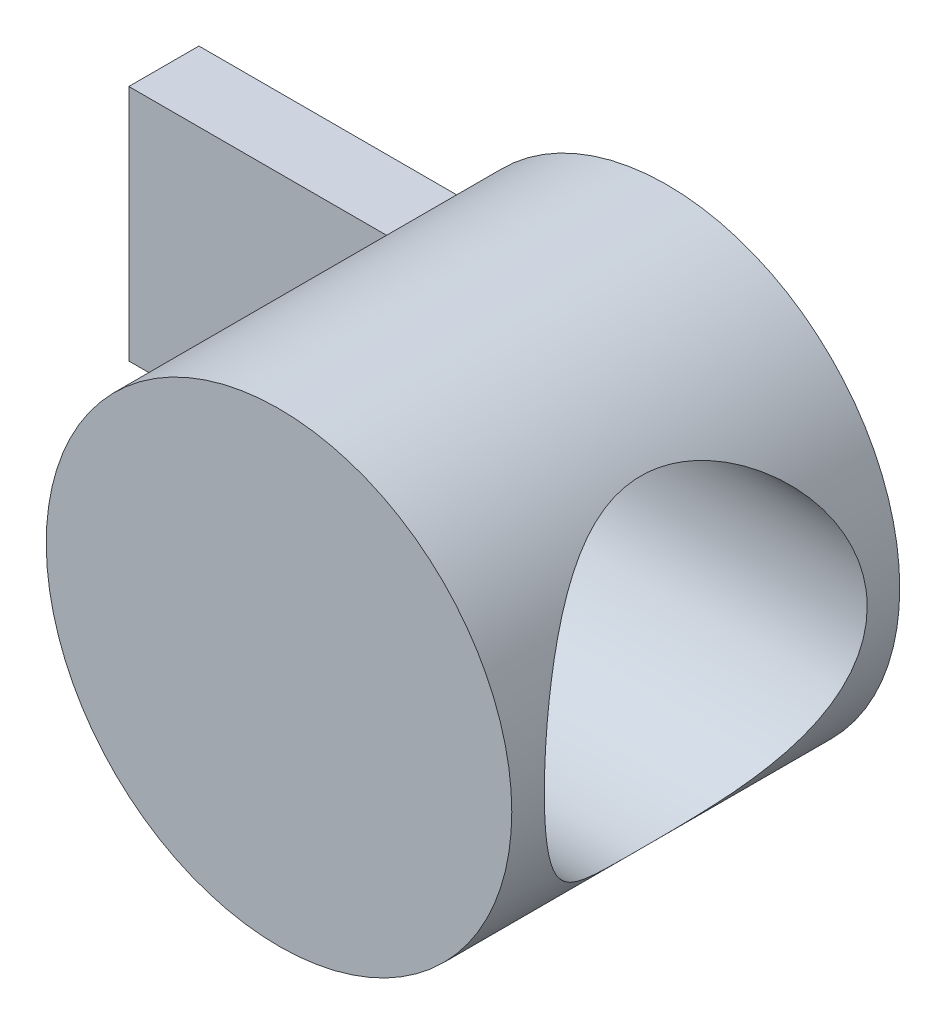
ISO-10303-21;
HEADER;
FILE_DESCRIPTION(('STEP AP214'),'2;1');
FILE_NAME('part.step','',(''),(''),'','','');
FILE_SCHEMA(('AUTOMOTIVE_DESIGN { 1 0 10303 214 1 1 1 1 }'));
ENDSEC;
DATA;
#1=APPLICATION_CONTEXT('core data for automotive mechanical design processes');
#2=APPLICATION_PROTOCOL_DEFINITION('international standard','automotive_design',2000,#1);
#3=PRODUCT_CONTEXT('',#1,'mechanical');
#4=PRODUCT('Part','Part','',(#3));
#5=PRODUCT_RELATED_PRODUCT_CATEGORY('part','',(#4));
#6=PRODUCT_DEFINITION_FORMATION('','',#4);
#7=PRODUCT_DEFINITION_CONTEXT('part definition',#1,'design');
#8=PRODUCT_DEFINITION('design','',#6,#7);
#9=PRODUCT_DEFINITION_SHAPE('','',#8);
#10=(LENGTH_UNIT() NAMED_UNIT(*) SI_UNIT(.MILLI.,.METRE.));
#11=(NAMED_UNIT(*) PLANE_ANGLE_UNIT() SI_UNIT($,.RADIAN.));
#12=(NAMED_UNIT(*) SI_UNIT($,.STERADIAN.) SOLID_ANGLE_UNIT());
#13=UNCERTAINTY_MEASURE_WITH_UNIT(LENGTH_MEASURE(1.E-05),#10,'distance_accuracy_value','');
#14=(GEOMETRIC_REPRESENTATION_CONTEXT(3) GLOBAL_UNCERTAINTY_ASSIGNED_CONTEXT((#13)) GLOBAL_UNIT_ASSIGNED_CONTEXT((#10,
#11,#12)) REPRESENTATION_CONTEXT('',''));
#15=CARTESIAN_POINT('',(0.,0.,0.));
#16=DIRECTION('',(0.,0.,1.));
#17=DIRECTION('',(1.,0.,0.));
#18=AXIS2_PLACEMENT_3D('',#15,#16,#17);
#19=CARTESIAN_POINT('',(0.,0.,15.5));
#20=DIRECTION('',(0.,0.,-1.));
#21=DIRECTION('',(-1.,0.,0.));
#22=AXIS2_PLACEMENT_3D('',#19,#20,#21);
#23=CYLINDRICAL_SURFACE('',#22,9.3);
#24=CARTESIAN_POINT('',(-9.3,0.,11.75));
#25=CARTESIAN_POINT('',(-9.29999934078412,-0.106874233268766,11.749999180276));
#26=CARTESIAN_POINT('',(-9.29815263414507,-0.213780663620482,11.7457107500647));
#27=CARTESIAN_POINT('',(-9.29081243090715,-0.426826724346443,11.7285993885596));
#28=CARTESIAN_POINT('',(-9.28531673348287,-0.532965852857977,11.715771306711));
#29=CARTESIAN_POINT('',(-9.27080661319075,-0.743860828145862,11.681678512347));
#30=CARTESIAN_POINT('',(-9.26178527161917,-0.84861353374658,11.6603972099269));
#31=CARTESIAN_POINT('',(-9.24046521006683,-1.0557832572438,11.6096267848474));
#32=CARTESIAN_POINT('',(-9.22816515052659,-1.15819930186121,11.5801343071946));
#33=CARTESIAN_POINT('',(-9.18689890316545,-1.46009212009065,11.4799956488516));
#34=CARTESIAN_POINT('',(-9.15349521209184,-1.65518930219288,11.3975278514409));
#35=CARTESIAN_POINT('',(-9.07808724187232,-2.02847750626869,11.2039226194193));
#36=CARTESIAN_POINT('',(-9.0360852577465,-2.20667302102981,11.0927928330926));
#37=CARTESIAN_POINT('',(-8.94516066600799,-2.55093806750831,10.838788181007));
#38=CARTESIAN_POINT('',(-8.89600190703451,-2.71600752173623,10.6946402257903));
#39=CARTESIAN_POINT('',(-8.79729337381444,-3.02048114043648,10.3814424423972));
#40=CARTESIAN_POINT('',(-8.74774339701491,-3.15987095744644,10.2123787879452));
#41=CARTESIAN_POINT('',(-8.65087908189079,-3.41644951141554,9.84307196779325));
#42=CARTESIAN_POINT('',(-8.60382407397571,-3.53206187427895,9.64164826862648));
#43=CARTESIAN_POINT('',(-8.54176808512715,-3.67845075700833,9.3256078287111));
#44=CARTESIAN_POINT('',(-8.52249813220127,-3.72275382070134,9.21789987898892));
#45=CARTESIAN_POINT('',(-8.48747098147271,-3.80193559161135,8.99854067347465));
#46=CARTESIAN_POINT('',(-8.4717119391076,-3.83681924964862,8.88689152419947));
#47=CARTESIAN_POINT('',(-8.44499413922509,-3.89526055433711,8.6661489879317));
#48=CARTESIAN_POINT('',(-8.43383508653355,-3.91929651105374,8.55720607891461));
#49=CARTESIAN_POINT('',(-8.41564352796143,-3.95820756216702,8.33740124317627));
#50=CARTESIAN_POINT('',(-8.40860907739749,-3.9730869738911,8.2265402462267));
#51=CARTESIAN_POINT('',(-8.39893093433346,-3.99350569509197,8.00380299327322));
#52=CARTESIAN_POINT('',(-8.39628592554187,-3.99904780461611,7.89192705174984));
#53=CARTESIAN_POINT('',(-8.39548594196916,-4.00072703931844,7.66809333122788));
#54=CARTESIAN_POINT('',(-8.39733070683432,-3.99686470984274,7.55613555735098));
#55=CARTESIAN_POINT('',(-8.40510128951635,-3.98049574440855,7.34236070583505));
#56=CARTESIAN_POINT('',(-8.41067563580138,-3.96873326871917,7.2404732959467));
#57=CARTESIAN_POINT('',(-8.42535088105403,-3.93748018147667,7.03813860421489));
#58=CARTESIAN_POINT('',(-8.43445292684826,-3.91798705670404,6.93769180172471));
#59=CARTESIAN_POINT('',(-8.46665073717504,-3.84818490807235,6.63957925078703));
#60=CARTESIAN_POINT('',(-8.4946451896979,-3.78653950211715,6.44496827714968));
#61=CARTESIAN_POINT('',(-8.56118850758204,-3.63360449382624,6.06479987089936));
#62=CARTESIAN_POINT('',(-8.59995502583085,-3.54169542939094,5.87953393075672));
#63=CARTESIAN_POINT('',(-8.68363263751936,-3.33126590260211,5.526274752652));
#64=CARTESIAN_POINT('',(-8.72854623551185,-3.21273458064965,5.35828860424911));
#65=CARTESIAN_POINT('',(-8.82440362438064,-2.93983406854868,5.02837170978374));
#66=CARTESIAN_POINT('',(-8.87552505478886,-2.7831907181036,4.86836897520677));
#67=CARTESIAN_POINT('',(-8.97462556172128,-2.44482257210579,4.57623037411741));
#68=CARTESIAN_POINT('',(-9.02260380117477,-2.2630911350004,4.44410191023653));
#69=CARTESIAN_POINT('',(-9.11157560302513,-1.87352107509898,4.20838234820323));
#70=CARTESIAN_POINT('',(-9.15235459201257,-1.66512557052148,4.10562455171741));
#71=CARTESIAN_POINT('',(-9.22066393286011,-1.231802188747,3.93731103593724));
#72=CARTESIAN_POINT('',(-9.24820209746839,-1.0068841512173,3.87173337440183));
#73=CARTESIAN_POINT('',(-9.28543781783168,-0.562963835350611,3.78378973918099));
#74=CARTESIAN_POINT('',(-9.29619993100833,-0.344562697171548,3.75884034090852));
#75=CARTESIAN_POINT('',(-9.30210631835257,0.0935553492091293,3.74509842029474));
#76=CARTESIAN_POINT('',(-9.29725545777301,0.313271826231779,3.75629463440459));
#77=CARTESIAN_POINT('',(-9.27316462522996,0.735358138867906,3.81272132058679));
#78=CARTESIAN_POINT('',(-9.25471022260221,0.93802636087062,3.85609450005673));
#79=CARTESIAN_POINT('',(-9.20612989877623,1.33296065437231,3.97301128994111));
#80=CARTESIAN_POINT('',(-9.17600252835549,1.52522543088338,4.04655864660739));
#81=CARTESIAN_POINT('',(-9.10576772262043,1.90069237245226,4.22411709843971));
#82=CARTESIAN_POINT('',(-9.06537793594593,2.08342384409009,4.32900802830656));
#83=CARTESIAN_POINT('',(-8.97886870487735,2.42935392665666,4.56532494888838));
#84=CARTESIAN_POINT('',(-8.9327468119742,2.59254413155178,4.69676229417836));
#85=CARTESIAN_POINT('',(-8.83538757077405,2.90777834795635,4.99404610841186));
#86=CARTESIAN_POINT('',(-8.78402763058276,3.05803679463846,5.16174682727339));
#87=CARTESIAN_POINT('',(-8.6850126328659,3.32887422255633,5.52085059270679));
#88=CARTESIAN_POINT('',(-8.63735863402144,3.44944474395696,5.71226037208272));
#89=CARTESIAN_POINT('',(-8.57253926855411,3.60622355596146,6.01550433026191));
#90=CARTESIAN_POINT('',(-8.55187857485843,3.65481540057085,6.12035722854021));
#91=CARTESIAN_POINT('',(-8.5136947691038,3.74290089859364,6.33435237892022));
#92=CARTESIAN_POINT('',(-8.49617026284308,3.78239859708683,6.44349269858844));
#93=CARTESIAN_POINT('',(-8.4649086499376,3.85185330548593,6.66523193313136));
#94=CARTESIAN_POINT('',(-8.45116958638418,3.88181524620982,6.77782902741711));
#95=CARTESIAN_POINT('',(-8.42800400647033,3.93185859039075,7.0056334179739));
#96=CARTESIAN_POINT('',(-8.41857704610956,3.95194101111933,7.12084044422785));
#97=CARTESIAN_POINT('',(-8.40499639289431,3.98073690178946,7.34344209145978));
#98=CARTESIAN_POINT('',(-8.40047714553189,3.9902400811904,7.45071286076214));
#99=CARTESIAN_POINT('',(-8.39556581784281,4.00056343144308,7.66580412283355));
#100=CARTESIAN_POINT('',(-8.39517511561209,4.00138070296539,7.77362478714143));
#101=CARTESIAN_POINT('',(-8.39854093335341,3.99431196645918,7.98886091773454));
#102=CARTESIAN_POINT('',(-8.40229517680469,3.98643073589348,8.09627657396331));
#103=CARTESIAN_POINT('',(-8.41380431862522,3.96207841716599,8.30992553311475));
#104=CARTESIAN_POINT('',(-8.42156072443419,3.94560409233551,8.41615837510979));
#105=CARTESIAN_POINT('',(-8.44943517608114,3.88574265171909,8.72063312961776));
#106=CARTESIAN_POINT('',(-8.47440811871978,3.83145767803314,8.91640872439248));
#107=CARTESIAN_POINT('',(-8.5349124628419,3.69469760362888,9.29596786059734));
#108=CARTESIAN_POINT('',(-8.57044687055007,3.61221447555759,9.47974796943226));
#109=CARTESIAN_POINT('',(-8.65080127343468,3.41549134866738,9.84275140853213));
#110=CARTESIAN_POINT('',(-8.69606130174304,3.29959542275885,10.0209805926403));
#111=CARTESIAN_POINT('',(-8.78962041264275,3.04161384615776,10.3564229243285));
#112=CARTESIAN_POINT('',(-8.83792065160676,2.89951819001953,10.5136280032826));
#113=CARTESIAN_POINT('',(-8.93676395515045,2.57959961143623,10.8155688397058));
#114=CARTESIAN_POINT('',(-8.98717888985869,2.39983164909883,10.9583116914461));
#115=CARTESIAN_POINT('',(-9.05730937116871,2.1130347440304,11.1482794279201));
#116=CARTESIAN_POINT('',(-9.07978704851892,2.01449043522898,11.2076163014576));
#117=CARTESIAN_POINT('',(-9.12229982890224,1.81226188644151,11.3177638796397));
#118=CARTESIAN_POINT('',(-9.14233606083652,1.70858005343363,11.3685785290019));
#119=CARTESIAN_POINT('',(-9.17913919693844,1.49821685409454,11.4605725790939));
#120=CARTESIAN_POINT('',(-9.19594731960261,1.3915964485553,11.5018750189968));
#121=CARTESIAN_POINT('',(-9.22614604700577,1.17481661259781,11.5752962214402));
#122=CARTESIAN_POINT('',(-9.23953828444775,1.06465890137355,11.6074193723253));
#123=CARTESIAN_POINT('',(-9.26249053354376,0.841890253675319,11.6620767750895));
#124=CARTESIAN_POINT('',(-9.27205986429463,0.729285997193563,11.6846343533202));
#125=CARTESIAN_POINT('',(-9.28711819880892,0.502342860747301,11.7199902661192));
#126=CARTESIAN_POINT('',(-9.2926101206456,0.388005281183421,11.7327955802456));
#127=CARTESIAN_POINT('',(-9.29732037675199,0.227836658726739,11.743766537126));
#128=CARTESIAN_POINT('',(-9.29832457710041,0.182308745964646,11.7461033260502));
#129=CARTESIAN_POINT('',(-9.29966453158249,0.0911891759995516,11.7492202375512));
#130=CARTESIAN_POINT('',(-9.30000028125215,0.0455975183728875,11.7500003497324));
#131=CARTESIAN_POINT('',(-9.3,0.,11.75));
#132=B_SPLINE_CURVE_WITH_KNOTS('',3,(#24,#25,#26,#27,#28,#29,#30,#31,#32,#33,#34,#35,#36,#37,
#38,#39,#40,#41,#42,#43,#44,#45,#46,#47,#48,#49,#50,#51,#52,#53,#54,#55,#56,#57,#58,#59,#60,#61,
#62,#63,#64,#65,#66,#67,#68,#69,#70,#71,#72,#73,#74,#75,#76,#77,#78,#79,#80,#81,#82,#83,#84,#85,
#86,#87,#88,#89,#90,#91,#92,#93,#94,#95,#96,#97,#98,#99,#100,#101,#102,#103,#104,#105,#106,#107,
#108,#109,#110,#111,#112,#113,#114,#115,#116,#117,#118,#119,#120,#121,#122,#123,#124,#125,#126,
#127,#128,#129,#130,#131),.UNSPECIFIED.,.T.,.F.,(4,2,2,2,2,2,2,2,2,2,2,2,2,2,2,2,2,2,2,2,2,2,2,
2,2,2,2,2,2,2,2,2,2,2,2,2,2,2,2,2,2,2,2,2,2,2,2,2,2,2,2,2,2,4),(0.,0.320576390821004,
0.641346307569463,0.962748887961545,1.2842829830251,1.92441462966298,2.56437563732342,
3.23521800483735,3.9064340492845,4.61337274264909,4.96711152448407,5.32066401843424,
5.65657411878873,5.99232571533231,6.32797660957559,6.66360804050502,6.97137934293791,
7.27925078337242,7.89447884807598,8.52317629633768,9.15213066653854,9.83807694083062,
10.5242051546997,11.2282116686491,11.93180227224,12.5886071982172,13.2452074730704,
13.8665973861656,14.4880644708068,15.1289443887639,15.7700990100569,16.459907644884,
17.1499126198456,17.5017140088176,17.8533586127833,18.2048210892942,18.5562473689412,
18.8791827744014,19.2022259713258,19.5250918320613,19.8480793911293,20.4592141144929,
21.0705229586467,21.7198484947643,22.3694225181124,23.0707765912912,23.4220300786806,
23.7731205284597,24.1193765943648,24.4654668475514,24.8107082120184,25.1557022593022,
25.2924741434739,25.4292469410257),.UNSPECIFIED.);
#133=CARTESIAN_POINT('',(-9.3,0.,11.75));
#134=VERTEX_POINT('',#133);
#135=EDGE_CURVE('E39',#134,#134,#132,.T.);
#136=ORIENTED_EDGE('',*,*,#135,.T.);
#137=EDGE_LOOP('',(#136));
#138=FACE_BOUND('',#137,.T.);
#139=CARTESIAN_POINT('',(9.3,0.,1.3));
#140=CARTESIAN_POINT('',(9.30000030059884,-0.160684692975626,1.29999967612022));
#141=CARTESIAN_POINT('',(9.29582699502672,-0.321365433450295,1.3060125600827));
#142=CARTESIAN_POINT('',(9.27923921282349,-0.641399010241401,1.32996456112811));
#143=CARTESIAN_POINT('',(9.26682500923532,-0.800751890376276,1.34790328307624));
#144=CARTESIAN_POINT('',(9.23405344534918,-1.11692807091194,1.39543165193953));
#145=CARTESIAN_POINT('',(9.21369344742395,-1.27375051330746,1.42502516772387));
#146=CARTESIAN_POINT('',(9.16550956391227,-1.58367781798145,1.49542383345956));
#147=CARTESIAN_POINT('',(9.13768551555252,-1.73678259910708,1.53622922791595));
#148=CARTESIAN_POINT('',(9.07534846747479,-2.03752446564334,1.62826888198986));
#149=CARTESIAN_POINT('',(9.04087062107354,-2.18518563069697,1.67944840162127));
#150=CARTESIAN_POINT('',(8.96584252858721,-2.4751020831585,1.79176452540616));
#151=CARTESIAN_POINT('',(8.92528990725224,-2.61735522861943,1.85290502514662));
#152=CARTESIAN_POINT('',(8.79569149143223,-3.03488602686606,2.05029746319019));
#153=CARTESIAN_POINT('',(8.69864900632044,-3.30119594132389,2.2006015311713));
#154=CARTESIAN_POINT('',(8.48082489060524,-3.82805946958879,2.54837715894583));
#155=CARTESIAN_POINT('',(8.3587077074098,-4.08605989979271,2.74882931098634));
#156=CARTESIAN_POINT('',(8.10580874783393,-4.56724569473422,3.18402364978175));
#157=CARTESIAN_POINT('',(7.97501425802662,-4.79037829368062,3.4188167852551));
#158=CARTESIAN_POINT('',(7.76854119553343,-5.11469011000686,3.81574562647055));
#159=CARTESIAN_POINT('',(7.69242558510279,-5.22815729768314,3.96780295438184));
#160=CARTESIAN_POINT('',(7.54276948124143,-5.44183948225767,4.28228885907147));
#161=CARTESIAN_POINT('',(7.46922964350721,-5.54205112255247,4.44472004736368));
#162=CARTESIAN_POINT('',(7.32733245539928,-5.72834150849989,4.77927405685594));
#163=CARTESIAN_POINT('',(7.25896709998613,-5.81444233477898,4.95138115917613));
#164=CARTESIAN_POINT('',(7.13005825251577,-5.97181870965071,5.30514188434257));
#165=CARTESIAN_POINT('',(7.06951475592891,-6.04309426682872,5.4867955016603));
#166=CARTESIAN_POINT('',(6.97629758330897,-6.15017500317575,5.8015744728154));
#167=CARTESIAN_POINT('',(6.94077793462674,-6.19014846076225,5.93245097220072));
#168=CARTESIAN_POINT('',(6.87603747129703,-6.26198437027122,6.19792175392127));
#169=CARTESIAN_POINT('',(6.84681480618301,-6.29384920553782,6.33251493090066));
#170=CARTESIAN_POINT('',(6.79570540058068,-6.34900025161402,6.60460433436697));
#171=CARTESIAN_POINT('',(6.77380716765242,-6.37229990741031,6.74209564969251));
#172=CARTESIAN_POINT('',(6.73813470007804,-6.4100092333413,7.01934948192986));
#173=CARTESIAN_POINT('',(6.72436046028778,-6.42441890910518,7.15911199740347));
#174=CARTESIAN_POINT('',(6.70547361816917,-6.44413021919976,7.44064143318234));
#175=CARTESIAN_POINT('',(6.70040878851075,-6.44938162097616,7.58241513475638));
#176=CARTESIAN_POINT('',(6.69931723747273,-6.45051537262394,7.86603339098638));
#177=CARTESIAN_POINT('',(6.70329049680195,-6.4463977424929,8.00787794549046));
#178=CARTESIAN_POINT('',(6.72010262495394,-6.42886990905126,8.29054731882248));
#179=CARTESIAN_POINT('',(6.73294689040208,-6.4154540491989,8.43137146416623));
#180=CARTESIAN_POINT('',(6.76693378101649,-6.37959272152353,8.71081553378684));
#181=CARTESIAN_POINT('',(6.78807658480601,-6.35714705933682,8.84943541055074));
#182=CARTESIAN_POINT('',(6.85965569240142,-6.28011884584318,9.24370293173274));
#183=CARTESIAN_POINT('',(6.91953444417909,-6.21460324293677,9.49558799858593));
#184=CARTESIAN_POINT('',(7.05876995677307,-6.05597155567975,9.98473792348802));
#185=CARTESIAN_POINT('',(7.13814212967654,-5.96283362012537,10.2219910264615));
#186=CARTESIAN_POINT('',(7.28877262275558,-5.77706375816231,10.6248317901757));
#187=CARTESIAN_POINT('',(7.35737460659062,-5.68972201902992,10.7939084324711));
#188=CARTESIAN_POINT('',(7.49921569240801,-5.5014229038746,11.1223424449841));
#189=CARTESIAN_POINT('',(7.57245662365064,-5.40046013876163,11.2816959318591));
#190=CARTESIAN_POINT('',(7.72132652296053,-5.18538877080651,11.5905359539434));
#191=CARTESIAN_POINT('',(7.79695944733277,-5.07125746269963,11.7400047264316));
#192=CARTESIAN_POINT('',(7.94838498449456,-4.83046606029636,12.0283609691461));
#193=CARTESIAN_POINT('',(8.02417757625526,-4.70380752586699,12.1672497529701));
#194=CARTESIAN_POINT('',(8.17482464113799,-4.43688883290407,12.4353693313254));
#195=CARTESIAN_POINT('',(8.24966000004352,-4.29649595212212,12.5644789218964));
#196=CARTESIAN_POINT('',(8.39567762861929,-4.0036688190295,12.8106041041267));
#197=CARTESIAN_POINT('',(8.46685956389058,-3.85123346769893,12.9276185897078));
#198=CARTESIAN_POINT('',(8.60363273901762,-3.53512508282307,13.1483781721553));
#199=CARTESIAN_POINT('',(8.6692338069495,-3.37147276095185,13.252146763845));
#200=CARTESIAN_POINT('',(8.7932211342629,-3.0334212617269,13.445501764931));
#201=CARTESIAN_POINT('',(8.85160955639146,-2.85902532951948,13.5350924279245));
#202=CARTESIAN_POINT('',(8.94753107015586,-2.54026212314615,13.6806916828321));
#203=CARTESIAN_POINT('',(8.98681841838026,-2.39780476585466,13.7397425357312));
#204=CARTESIAN_POINT('',(9.05925637627678,-2.10765686543819,13.847888145812));
#205=CARTESIAN_POINT('',(9.09240821330012,-1.95996737600989,13.8969848944067));
#206=CARTESIAN_POINT('',(9.15188586940954,-1.66021679664731,13.9846251207674));
#207=CARTESIAN_POINT('',(9.17821490846468,-1.50815780664581,14.0231735772044));
#208=CARTESIAN_POINT('',(9.22349173419947,-1.20056747238356,14.0892333050152));
#209=CARTESIAN_POINT('',(9.24243936508646,-1.04503605490669,14.1167443434325));
#210=CARTESIAN_POINT('',(9.27257187780538,-0.731015472207083,14.1604087562441));
#211=CARTESIAN_POINT('',(9.28372637842808,-0.572517177558894,14.1765176831211));
#212=CARTESIAN_POINT('',(9.29788315742266,-0.254397000086605,14.1969516605645));
#213=CARTESIAN_POINT('',(9.30088543894707,-0.0947751176970301,14.2012767156878));
#214=CARTESIAN_POINT('',(9.29866362972134,0.224291303470912,14.1980730957448));
#215=CARTESIAN_POINT('',(9.29343955104981,0.383735842509325,14.1905444380831));
#216=CARTESIAN_POINT('',(9.27489419949206,0.70115204494005,14.1637551644443));
#217=CARTESIAN_POINT('',(9.2615731853781,0.859123755239097,14.1444949234002));
#218=CARTESIAN_POINT('',(9.22821253025731,1.16273644576716,14.096077160387));
#219=CARTESIAN_POINT('',(9.20863690332251,1.3085379073466,14.0676018068844));
#220=CARTESIAN_POINT('',(9.16303835488074,1.5968963517158,14.0009482999171));
#221=CARTESIAN_POINT('',(9.13701323616054,1.73945221068436,13.962766839661));
#222=CARTESIAN_POINT('',(9.0499966867389,2.16093236312828,13.8343215725962));
#223=CARTESIAN_POINT('',(8.98003681587164,2.43390667544746,13.7301181578061));
#224=CARTESIAN_POINT('',(8.81521520579561,2.97806574093153,13.4797512044824));
#225=CARTESIAN_POINT('',(8.71889183255304,3.24761746177637,13.3310495931057));
#226=CARTESIAN_POINT('',(8.51096113819131,3.75896278011342,13.0002861226703));
#227=CARTESIAN_POINT('',(8.39934355510809,4.00073753812475,12.8182018368584));
#228=CARTESIAN_POINT('',(8.14812137541194,4.49298215655335,12.3910400904227));
#229=CARTESIAN_POINT('',(8.00698595799432,4.73793387659465,12.1405158956944));
#230=CARTESIAN_POINT('',(7.72519231841872,5.18469513612888,11.602750052162));
#231=CARTESIAN_POINT('',(7.58453448451063,5.38647532343048,11.3154836331294));
#232=CARTESIAN_POINT('',(7.39230004741777,5.6439135850355,10.876221551771));
#233=CARTESIAN_POINT('',(7.33463494221034,5.71848653104393,10.737705536632));
#234=CARTESIAN_POINT('',(7.22374605660164,5.85793531218155,10.4540830493545));
#235=CARTESIAN_POINT('',(7.17052278621463,5.92281003442942,10.3089758233549));
#236=CARTESIAN_POINT('',(7.07023087118603,6.042177857464,10.0127525804178));
#237=CARTESIAN_POINT('',(7.02315334494095,6.09668599293217,9.86164565559846));
#238=CARTESIAN_POINT('',(6.93681822714979,6.19474165834642,9.55381170288653));
#239=CARTESIAN_POINT('',(6.89755554627571,6.23829632651465,9.3970884115928));
#240=CARTESIAN_POINT('',(6.83508368372677,6.30661153904949,9.10894602185533));
#241=CARTESIAN_POINT('',(6.8102425430282,6.33336903190211,8.97835264614034));
#242=CARTESIAN_POINT('',(6.76765874222282,6.37885330305577,8.71468253785483));
#243=CARTESIAN_POINT('',(6.74991249864539,6.39758413578407,8.58160709455983));
#244=CARTESIAN_POINT('',(6.72218037880916,6.42671754096568,8.3138449895283));
#245=CARTESIAN_POINT('',(6.71218832328848,6.43712674507056,8.17915969776576));
#246=CARTESIAN_POINT('',(6.70034226828974,6.44945632186211,7.90903827832462));
#247=CARTESIAN_POINT('',(6.69848837777747,6.45137658088622,7.7736021406169));
#248=CARTESIAN_POINT('',(6.70300167896587,6.44668778024369,7.50293480965303));
#249=CARTESIAN_POINT('',(6.70937355215976,6.44007386355966,7.36770377699448));
#250=CARTESIAN_POINT('',(6.73006890263535,6.41844030073444,7.09855859362561));
#251=CARTESIAN_POINT('',(6.74439233247172,6.40342070474821,6.96464443506263));
#252=CARTESIAN_POINT('',(6.79855649763391,6.34606408200479,6.56594960757604));
#253=CARTESIAN_POINT('',(6.84958775325002,6.29143214152601,6.30436286980359));
#254=CARTESIAN_POINT('',(6.99330468437247,6.13173046397074,5.71983034014736));
#255=CARTESIAN_POINT('',(7.09384813486263,6.01651900257317,5.40163509187513));
#256=CARTESIAN_POINT('',(7.26158229272787,5.81096327601376,4.94587440419248));
#257=CARTESIAN_POINT('',(7.32039060293102,5.73688459165512,4.79738517972842));
#258=CARTESIAN_POINT('',(7.4419333568924,5.57831718766223,4.50776141632304));
#259=CARTESIAN_POINT('',(7.50466755683136,5.49382911419297,4.36662642163948));
#260=CARTESIAN_POINT('',(7.69922184385102,5.22133470108361,3.94834600170556));
#261=CARTESIAN_POINT('',(7.8347880359306,5.01734576820614,3.68304225298069));
#262=CARTESIAN_POINT('',(8.03634892010436,4.68233051923729,3.31083682683724));
#263=CARTESIAN_POINT('',(8.1032681166816,4.56575995139475,3.19101097499962));
#264=CARTESIAN_POINT('',(8.23530228331592,4.32305983943923,2.96025206629257));
#265=CARTESIAN_POINT('',(8.30041695185293,4.19692871083911,2.84932048978219));
#266=CARTESIAN_POINT('',(8.43806217543411,3.91379852091546,2.61938445999128));
#267=CARTESIAN_POINT('',(8.51003849510532,3.75514408617353,2.50207845287925));
#268=CARTESIAN_POINT('',(8.64781845635406,3.42593834247435,2.28148299830772));
#269=CARTESIAN_POINT('',(8.71362477153596,3.2553922428331,2.17818747103891));
#270=CARTESIAN_POINT('',(8.83716386194721,2.90332664770016,1.98690266324325));
#271=CARTESIAN_POINT('',(8.89490357300106,2.72181677385603,1.89890021734483));
#272=CARTESIAN_POINT('',(9.00055838552696,2.34892689129108,1.73949960786153));
#273=CARTESIAN_POINT('',(9.04847687775819,2.15755031768776,1.66809571250879));
#274=CARTESIAN_POINT('',(9.12438885880296,1.80585098432944,1.55578363756056));
#275=CARTESIAN_POINT('',(9.15445110158603,1.64700354845395,1.51163118852298));
#276=CARTESIAN_POINT('',(9.20654738180354,1.32515639030846,1.43543029870483));
#277=CARTESIAN_POINT('',(9.22858323259557,1.16215761484183,1.40337912389153));
#278=CARTESIAN_POINT('',(9.26405961906741,0.833377502029956,1.35190276922586));
#279=CARTESIAN_POINT('',(9.27750666108599,0.667598368847151,1.33246803177467));
#280=CARTESIAN_POINT('',(9.29547665417882,0.334544720252417,1.30651687496502));
#281=CARTESIAN_POINT('',(9.29999968708137,0.167270218566329,1.30000033715372));
#282=CARTESIAN_POINT('',(9.3,0.,1.3));
#283=B_SPLINE_CURVE_WITH_KNOTS('',3,(#139,#140,#141,#142,#143,#144,#145,#146,#147,#148,#149,
#150,#151,#152,#153,#154,#155,#156,#157,#158,#159,#160,#161,#162,#163,#164,#165,#166,#167,#168,
#169,#170,#171,#172,#173,#174,#175,#176,#177,#178,#179,#180,#181,#182,#183,#184,#185,#186,#187,
#188,#189,#190,#191,#192,#193,#194,#195,#196,#197,#198,#199,#200,#201,#202,#203,#204,#205,#206,
#207,#208,#209,#210,#211,#212,#213,#214,#215,#216,#217,#218,#219,#220,#221,#222,#223,#224,#225,
#226,#227,#228,#229,#230,#231,#232,#233,#234,#235,#236,#237,#238,#239,#240,#241,#242,#243,#244,
#245,#246,#247,#248,#249,#250,#251,#252,#253,#254,#255,#256,#257,#258,#259,#260,#261,#262,#263,
#264,#265,#266,#267,#268,#269,#270,#271,#272,#273,#274,#275,#276,#277,#278,#279,#280,#281,#282),
.UNSPECIFIED.,.T.,.F.,(4,2,2,2,2,2,2,2,2,2,2,2,2,2,2,2,2,2,2,2,2,2,2,2,2,2,2,2,2,2,2,2,2,2,2,2,
2,2,2,2,2,2,2,2,2,2,2,2,2,2,2,2,2,2,2,2,2,2,2,2,2,2,2,2,2,2,2,2,2,2,2,4),(0.,0.481882161932884,
0.963748358620903,1.44577464829903,1.92781145068633,2.40736802646581,2.88711260168721,
3.84577413864855,4.88851192321003,5.93281272133913,6.54549488021649,7.15833188823254,
7.77020057734629,8.38206891212322,8.80583799558354,9.22948237756391,9.65245888514742,
10.0754351249004,10.5007241507314,10.9260122688125,11.3515593366146,11.7771155646764,
12.5751386388091,13.3737946967784,13.9799280292096,14.586301882385,15.1937373281295,
15.801097232134,16.4150500795937,17.0290590224877,17.6419632725514,18.2546832918558,
18.7316208837512,19.2084629654065,19.6850795934206,20.1617062804035,20.6401808627221,
21.118655260011,21.5971289547662,22.0755873586497,22.5245956618552,22.973757144031,
23.8713619982743,24.8355128488168,25.8003138131942,26.9292492461129,28.058949816608,
28.5612380779011,29.063583933127,29.5651955846022,30.0664794906827,30.472874666185,
30.8790643206564,31.2849299519013,31.6908010174589,32.0969031765219,32.5030029124818,
33.3156356698624,34.3687524367713,34.8965212368418,35.4242572920449,36.5029779054292,
37.0428339918813,37.5827797460056,38.2120122858585,38.8409708923532,39.4693853350483,
40.0975824518906,40.5997130073236,41.1017300487567,41.6033663413418,42.1049980341749),.UNSPECIFIED.);
#284=CARTESIAN_POINT('',(9.3,0.,1.3));
#285=VERTEX_POINT('',#284);
#286=EDGE_CURVE('E11',#285,#285,#283,.T.);
#287=ORIENTED_EDGE('',*,*,#286,.T.);
#288=EDGE_LOOP('',(#287));
#289=FACE_BOUND('',#288,.T.);
#290=CARTESIAN_POINT('',(0.,0.,15.5));
#291=DIRECTION('',(0.,0.,1.));
#292=DIRECTION('',(1.,0.,0.));
#293=AXIS2_PLACEMENT_3D('',#290,#291,#292);
#294=CIRCLE('',#293,9.3);
#295=CARTESIAN_POINT('',(9.3,0.,15.5));
#296=VERTEX_POINT('',#295);
#297=EDGE_CURVE('E115',#296,#296,#294,.T.);
#298=ORIENTED_EDGE('',*,*,#297,.F.);
#299=EDGE_LOOP('',(#298));
#300=FACE_BOUND('',#299,.T.);
#301=DIRECTION('',(0.,0.,-1.));
#302=VECTOR('',#301,1.);
#303=CARTESIAN_POINT('',(-7.99546746600848,4.75,2.8));
#304=LINE('',#303,#302);
#305=CARTESIAN_POINT('',(-7.99546746600848,4.75,2.8));
#306=VERTEX_POINT('',#305);
#307=CARTESIAN_POINT('',(-7.99546746600848,4.75,0.));
#308=VERTEX_POINT('',#307);
#309=EDGE_CURVE('E55',#306,#308,#304,.T.);
#310=ORIENTED_EDGE('',*,*,#309,.F.);
#311=CARTESIAN_POINT('',(0.,0.,2.8));
#312=DIRECTION('',(0.,0.,-1.));
#313=DIRECTION('',(-1.,0.,0.));
#314=AXIS2_PLACEMENT_3D('',#311,#312,#313);
#315=CIRCLE('',#314,9.3);
#316=CARTESIAN_POINT('',(-7.99546746600848,-4.75,2.8));
#317=VERTEX_POINT('',#316);
#318=EDGE_CURVE('E48',#317,#306,#315,.T.);
#319=ORIENTED_EDGE('',*,*,#318,.F.);
#320=DIRECTION('',(0.,0.,-1.));
#321=VECTOR('',#320,1.);
#322=CARTESIAN_POINT('',(-7.99546746600848,-4.75,2.8));
#323=LINE('',#322,#321);
#324=CARTESIAN_POINT('',(-7.99546746600848,-4.75,0.));
#325=VERTEX_POINT('',#324);
#326=EDGE_CURVE('E101',#317,#325,#323,.T.);
#327=ORIENTED_EDGE('',*,*,#326,.T.);
#328=CARTESIAN_POINT('',(0.,0.,0.));
#329=DIRECTION('',(0.,0.,1.));
#330=DIRECTION('',(1.,0.,0.));
#331=AXIS2_PLACEMENT_3D('',#328,#329,#330);
#332=CIRCLE('',#331,9.3);
#333=EDGE_CURVE('E114',#325,#308,#332,.T.);
#334=ORIENTED_EDGE('',*,*,#333,.T.);
#335=EDGE_LOOP('',(#310,#319,#327,#334));
#336=FACE_BOUND('',#335,.T.);
#337=ADVANCED_FACE('F35',(#138,#289,#300,#336),#23,.T.);
#338=CARTESIAN_POINT('',(0.,0.,15.5));
#339=DIRECTION('',(0.,0.,1.));
#340=DIRECTION('',(1.,0.,0.));
#341=AXIS2_PLACEMENT_3D('',#338,#339,#340);
#342=PLANE('',#341);
#343=ORIENTED_EDGE('',*,*,#297,.T.);
#344=EDGE_LOOP('',(#343));
#345=FACE_BOUND('',#344,.T.);
#346=ADVANCED_FACE('F141',(#345),#342,.T.);
#347=CARTESIAN_POINT('',(0.,0.,0.));
#348=DIRECTION('',(0.,0.,1.));
#349=DIRECTION('',(1.,0.,0.));
#350=AXIS2_PLACEMENT_3D('',#347,#348,#349);
#351=PLANE('',#350);
#352=ORIENTED_EDGE('',*,*,#333,.F.);
#353=DIRECTION('',(1.,0.,0.));
#354=VECTOR('',#353,1.);
#355=CARTESIAN_POINT('',(-7.99546746600848,-4.75,0.));
#356=LINE('',#355,#354);
#357=CARTESIAN_POINT('',(-18.7,-4.75,0.));
#358=VERTEX_POINT('',#357);
#359=EDGE_CURVE('E85',#358,#325,#356,.T.);
#360=ORIENTED_EDGE('',*,*,#359,.F.);
#361=DIRECTION('',(0.,-1.,0.));
#362=VECTOR('',#361,1.);
#363=CARTESIAN_POINT('',(-18.7,4.75,0.));
#364=LINE('',#363,#362);
#365=CARTESIAN_POINT('',(-18.7,4.75,0.));
#366=VERTEX_POINT('',#365);
#367=EDGE_CURVE('E106',#366,#358,#364,.T.);
#368=ORIENTED_EDGE('',*,*,#367,.F.);
#369=DIRECTION('',(-1.,0.,0.));
#370=VECTOR('',#369,1.);
#371=CARTESIAN_POINT('',(-7.99546746600848,4.75,0.));
#372=LINE('',#371,#370);
#373=EDGE_CURVE('E91',#308,#366,#372,.T.);
#374=ORIENTED_EDGE('',*,*,#373,.F.);
#375=EDGE_LOOP('',(#352,#360,#368,#374));
#376=FACE_BOUND('',#375,.T.);
#377=ADVANCED_FACE('F140',(#376),#351,.F.);
#378=CARTESIAN_POINT('',(-7.99546746600848,4.75,2.8));
#379=DIRECTION('',(0.,-1.,0.));
#380=DIRECTION('',(1.,0.,0.));
#381=AXIS2_PLACEMENT_3D('',#378,#379,#380);
#382=PLANE('',#381);
#383=ORIENTED_EDGE('',*,*,#373,.T.);
#384=DIRECTION('',(0.,0.,-1.));
#385=VECTOR('',#384,1.);
#386=CARTESIAN_POINT('',(-18.7,4.75,2.8));
#387=LINE('',#386,#385);
#388=CARTESIAN_POINT('',(-18.7,4.75,2.8));
#389=VERTEX_POINT('',#388);
#390=EDGE_CURVE('E88',#389,#366,#387,.T.);
#391=ORIENTED_EDGE('',*,*,#390,.F.);
#392=DIRECTION('',(-1.,0.,0.));
#393=VECTOR('',#392,1.);
#394=CARTESIAN_POINT('',(-7.99546746600848,4.75,2.8));
#395=LINE('',#394,#393);
#396=EDGE_CURVE('E78',#306,#389,#395,.T.);
#397=ORIENTED_EDGE('',*,*,#396,.F.);
#398=ORIENTED_EDGE('',*,*,#309,.T.);
#399=EDGE_LOOP('',(#383,#391,#397,#398));
#400=FACE_BOUND('',#399,.T.);
#401=ADVANCED_FACE('F89',(#400),#382,.F.);
#402=CARTESIAN_POINT('',(-18.7,4.75,2.8));
#403=DIRECTION('',(1.,0.,0.));
#404=DIRECTION('',(0.,0.,-1.));
#405=AXIS2_PLACEMENT_3D('',#402,#403,#404);
#406=PLANE('',#405);
#407=ORIENTED_EDGE('',*,*,#367,.T.);
#408=DIRECTION('',(0.,0.,-1.));
#409=VECTOR('',#408,1.);
#410=CARTESIAN_POINT('',(-18.7,-4.75,2.8));
#411=LINE('',#410,#409);
#412=CARTESIAN_POINT('',(-18.7,-4.75,2.8));
#413=VERTEX_POINT('',#412);
#414=EDGE_CURVE('E94',#413,#358,#411,.T.);
#415=ORIENTED_EDGE('',*,*,#414,.F.);
#416=DIRECTION('',(0.,-1.,0.));
#417=VECTOR('',#416,1.);
#418=CARTESIAN_POINT('',(-18.7,4.75,2.8));
#419=LINE('',#418,#417);
#420=EDGE_CURVE('E82',#389,#413,#419,.T.);
#421=ORIENTED_EDGE('',*,*,#420,.F.);
#422=ORIENTED_EDGE('',*,*,#390,.T.);
#423=EDGE_LOOP('',(#407,#415,#421,#422));
#424=FACE_BOUND('',#423,.T.);
#425=ADVANCED_FACE('F96',(#424),#406,.F.);
#426=CARTESIAN_POINT('',(-7.99546746600848,-4.75,2.8));
#427=DIRECTION('',(0.,1.,0.));
#428=DIRECTION('',(-1.,0.,0.));
#429=AXIS2_PLACEMENT_3D('',#426,#427,#428);
#430=PLANE('',#429);
#431=ORIENTED_EDGE('',*,*,#359,.T.);
#432=ORIENTED_EDGE('',*,*,#326,.F.);
#433=DIRECTION('',(1.,0.,0.));
#434=VECTOR('',#433,1.);
#435=CARTESIAN_POINT('',(-7.99546746600848,-4.75,2.8));
#436=LINE('',#435,#434);
#437=EDGE_CURVE('E99',#413,#317,#436,.T.);
#438=ORIENTED_EDGE('',*,*,#437,.F.);
#439=ORIENTED_EDGE('',*,*,#414,.T.);
#440=EDGE_LOOP('',(#431,#432,#438,#439));
#441=FACE_BOUND('',#440,.T.);
#442=ADVANCED_FACE('F132',(#441),#430,.F.);
#443=CARTESIAN_POINT('',(0.,0.,2.8));
#444=DIRECTION('',(0.,0.,-1.));
#445=DIRECTION('',(-1.,0.,0.));
#446=AXIS2_PLACEMENT_3D('',#443,#444,#445);
#447=PLANE('',#446);
#448=ORIENTED_EDGE('',*,*,#437,.T.);
#449=ORIENTED_EDGE('',*,*,#318,.T.);
#450=ORIENTED_EDGE('',*,*,#396,.T.);
#451=ORIENTED_EDGE('',*,*,#420,.T.);
#452=EDGE_LOOP('',(#448,#449,#450,#451));
#453=FACE_BOUND('',#452,.T.);
#454=ADVANCED_FACE('F80',(#453),#447,.F.);
#455=CARTESIAN_POINT('',(-2.,0.,7.75));
#456=DIRECTION('',(1.,0.,0.));
#457=DIRECTION('',(0.,0.,-1.));
#458=AXIS2_PLACEMENT_3D('',#455,#456,#457);
#459=CYLINDRICAL_SURFACE('',#458,6.45);
#460=CARTESIAN_POINT('',(-2.,0.,7.75));
#461=DIRECTION('',(1.,0.,0.));
#462=DIRECTION('',(0.,0.,-1.));
#463=AXIS2_PLACEMENT_3D('',#460,#461,#462);
#464=CIRCLE('',#463,6.45);
#465=CARTESIAN_POINT('',(-2.,0.,1.3));
#466=VERTEX_POINT('',#465);
#467=EDGE_CURVE('E107',#466,#466,#464,.T.);
#468=ORIENTED_EDGE('',*,*,#467,.F.);
#469=EDGE_LOOP('',(#468));
#470=FACE_BOUND('',#469,.T.);
#471=ORIENTED_EDGE('',*,*,#286,.F.);
#472=EDGE_LOOP('',(#471));
#473=FACE_BOUND('',#472,.T.);
#474=ADVANCED_FACE('F123',(#470,#473),#459,.F.);
#475=CARTESIAN_POINT('',(-2.,0.,7.75));
#476=DIRECTION('',(1.,0.,0.));
#477=DIRECTION('',(0.,0.,-1.));
#478=AXIS2_PLACEMENT_3D('',#475,#476,#477);
#479=PLANE('',#478);
#480=CARTESIAN_POINT('',(-2.,0.,7.75));
#481=DIRECTION('',(1.,0.,0.));
#482=DIRECTION('',(0.,0.,-1.));
#483=AXIS2_PLACEMENT_3D('',#480,#481,#482);
#484=CIRCLE('',#483,4.);
#485=CARTESIAN_POINT('',(-2.,0.,3.75));
#486=VERTEX_POINT('',#485);
#487=EDGE_CURVE('E160',#486,#486,#484,.T.);
#488=ORIENTED_EDGE('',*,*,#487,.F.);
#489=EDGE_LOOP('',(#488));
#490=FACE_BOUND('',#489,.T.);
#491=ORIENTED_EDGE('',*,*,#467,.T.);
#492=EDGE_LOOP('',(#491));
#493=FACE_BOUND('',#492,.T.);
#494=ADVANCED_FACE('F128',(#490,#493),#479,.T.);
#495=CARTESIAN_POINT('',(-18.7,0.,7.75));
#496=DIRECTION('',(1.,0.,0.));
#497=DIRECTION('',(0.,0.,-1.));
#498=AXIS2_PLACEMENT_3D('',#495,#496,#497);
#499=CYLINDRICAL_SURFACE('',#498,4.);
#500=ORIENTED_EDGE('',*,*,#487,.T.);
#501=EDGE_LOOP('',(#500));
#502=FACE_BOUND('',#501,.T.);
#503=ORIENTED_EDGE('',*,*,#135,.F.);
#504=EDGE_LOOP('',(#503));
#505=FACE_BOUND('',#504,.T.);
#506=ADVANCED_FACE('F166',(#502,#505),#499,.F.);
#507=CLOSED_SHELL('',(#337,#346,#377,#401,#425,#442,#454,#474,#494,#506));
#508=MANIFOLD_SOLID_BREP('B2',#507);
#509=ADVANCED_BREP_SHAPE_REPRESENTATION('',(#18,#508),#14);
#510=SHAPE_DEFINITION_REPRESENTATION(#9,#509);
ENDSEC;
END-ISO-10303-21;
